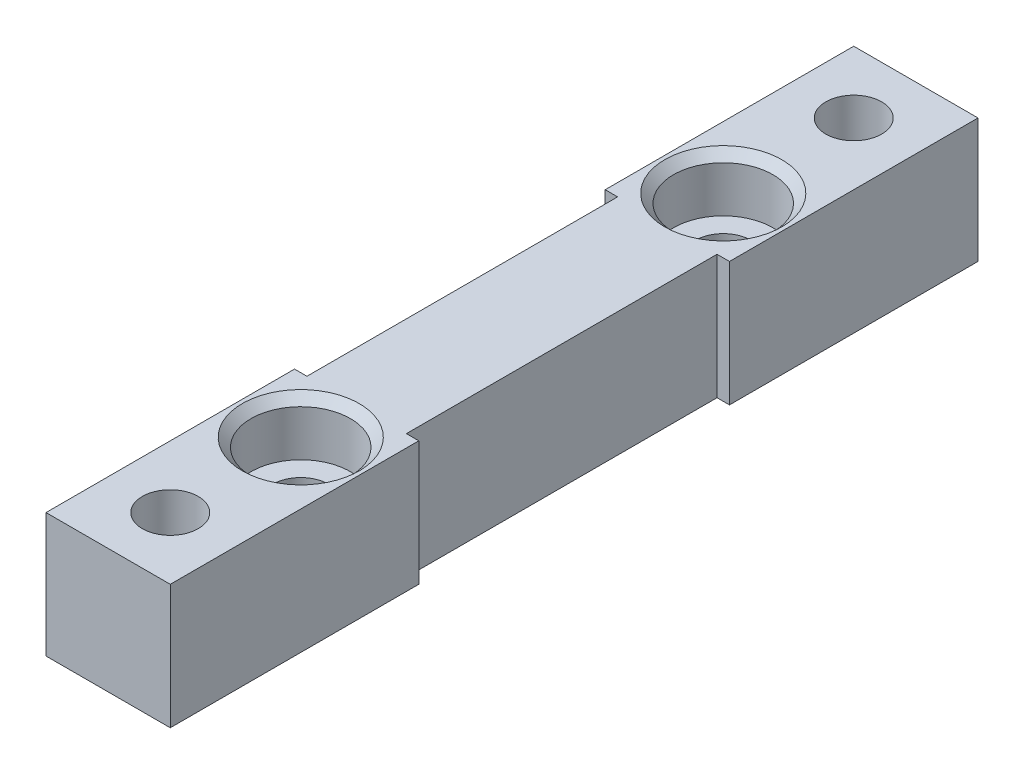
ISO-10303-21;
HEADER;
FILE_DESCRIPTION(('STEP AP214'),'2;1');
FILE_NAME('part.step','',(''),(''),'','','');
FILE_SCHEMA(('AUTOMOTIVE_DESIGN { 1 0 10303 214 1 1 1 1 }'));
ENDSEC;
DATA;
#1=APPLICATION_CONTEXT('core data for automotive mechanical design processes');
#2=APPLICATION_PROTOCOL_DEFINITION('international standard','automotive_design',2000,#1);
#3=PRODUCT_CONTEXT('',#1,'mechanical');
#4=PRODUCT('Part','Part','',(#3));
#5=PRODUCT_RELATED_PRODUCT_CATEGORY('part','',(#4));
#6=PRODUCT_DEFINITION_FORMATION('','',#4);
#7=PRODUCT_DEFINITION_CONTEXT('part definition',#1,'design');
#8=PRODUCT_DEFINITION('design','',#6,#7);
#9=PRODUCT_DEFINITION_SHAPE('','',#8);
#10=(LENGTH_UNIT() NAMED_UNIT(*) SI_UNIT(.MILLI.,.METRE.));
#11=(NAMED_UNIT(*) PLANE_ANGLE_UNIT() SI_UNIT($,.RADIAN.));
#12=(NAMED_UNIT(*) SI_UNIT($,.STERADIAN.) SOLID_ANGLE_UNIT());
#13=UNCERTAINTY_MEASURE_WITH_UNIT(LENGTH_MEASURE(1.E-05),#10,'distance_accuracy_value','');
#14=(GEOMETRIC_REPRESENTATION_CONTEXT(3) GLOBAL_UNCERTAINTY_ASSIGNED_CONTEXT((#13)) GLOBAL_UNIT_ASSIGNED_CONTEXT((#10,
#11,#12)) REPRESENTATION_CONTEXT('',''));
#15=CARTESIAN_POINT('',(0.,0.,0.));
#16=DIRECTION('',(0.,0.,1.));
#17=DIRECTION('',(1.,0.,0.));
#18=AXIS2_PLACEMENT_3D('',#15,#16,#17);
#19=CARTESIAN_POINT('',(0.,0.,0.));
#20=DIRECTION('',(0.,1.,0.));
#21=DIRECTION('',(0.,0.,1.));
#22=AXIS2_PLACEMENT_3D('',#19,#20,#21);
#23=PLANE('',#22);
#24=DIRECTION('',(-0.5,0.,0.866025403784438));
#25=VECTOR('',#24,1.);
#26=CARTESIAN_POINT('',(-8.83345911860128,0.,-5.10000000000001));
#27=LINE('',#26,#25);
#28=CARTESIAN_POINT('',(4.09918691124635,0.,-27.5));
#29=VERTEX_POINT('',#28);
#30=CARTESIAN_POINT('',(2.04959345562318,0.,-23.95));
#31=VERTEX_POINT('',#30);
#32=EDGE_CURVE('E231',#29,#31,#27,.T.);
#33=ORIENTED_EDGE('',*,*,#32,.F.);
#34=DIRECTION('',(0.5,0.,0.866025403784439));
#35=VECTOR('',#34,1.);
#36=CARTESIAN_POINT('',(14.9822394854708,0.,-8.65));
#37=LINE('',#36,#35);
#38=CARTESIAN_POINT('',(2.04959345562318,0.,-31.05));
#39=VERTEX_POINT('',#38);
#40=EDGE_CURVE('E49',#39,#29,#37,.T.);
#41=ORIENTED_EDGE('',*,*,#40,.F.);
#42=DIRECTION('',(1.,0.,0.));
#43=VECTOR('',#42,1.);
#44=CARTESIAN_POINT('',(0.,0.,-31.05));
#45=LINE('',#44,#43);
#46=CARTESIAN_POINT('',(-2.04959345562317,0.,-31.05));
#47=VERTEX_POINT('',#46);
#48=EDGE_CURVE('E220',#47,#39,#45,.T.);
#49=ORIENTED_EDGE('',*,*,#48,.F.);
#50=DIRECTION('',(0.5,0.,-0.866025403784438));
#51=VECTOR('',#50,1.);
#52=CARTESIAN_POINT('',(-14.9822394854708,0.,-8.65000000000001));
#53=LINE('',#52,#51);
#54=CARTESIAN_POINT('',(-4.09918691124634,0.,-27.5));
#55=VERTEX_POINT('',#54);
#56=EDGE_CURVE('E240',#55,#47,#53,.T.);
#57=ORIENTED_EDGE('',*,*,#56,.F.);
#58=DIRECTION('',(-0.5,0.,-0.866025403784439));
#59=VECTOR('',#58,1.);
#60=CARTESIAN_POINT('',(8.83345911860127,0.,-5.1));
#61=LINE('',#60,#59);
#62=CARTESIAN_POINT('',(-2.04959345562317,0.,-23.95));
#63=VERTEX_POINT('',#62);
#64=EDGE_CURVE('E237',#63,#55,#61,.T.);
#65=ORIENTED_EDGE('',*,*,#64,.F.);
#66=DIRECTION('',(-1.,0.,0.));
#67=VECTOR('',#66,1.);
#68=CARTESIAN_POINT('',(0.,0.,-23.95));
#69=LINE('',#68,#67);
#70=EDGE_CURVE('E234',#31,#63,#69,.T.);
#71=ORIENTED_EDGE('',*,*,#70,.F.);
#72=EDGE_LOOP('',(#33,#41,#49,#57,#65,#71));
#73=FACE_BOUND('',#72,.T.);
#74=DIRECTION('',(1.,0.,0.));
#75=VECTOR('',#74,1.);
#76=CARTESIAN_POINT('',(0.,0.,12.5));
#77=LINE('',#76,#75);
#78=CARTESIAN_POINT('',(4.,0.,12.5));
#79=VERTEX_POINT('',#78);
#80=CARTESIAN_POINT('',(5.00000000000001,0.,12.5));
#81=VERTEX_POINT('',#80);
#82=EDGE_CURVE('E333',#79,#81,#77,.T.);
#83=ORIENTED_EDGE('',*,*,#82,.T.);
#84=DIRECTION('',(0.,0.,-1.));
#85=VECTOR('',#84,1.);
#86=CARTESIAN_POINT('',(5.00000000000001,0.,0.));
#87=LINE('',#86,#85);
#88=CARTESIAN_POINT('',(5.,0.,32.5));
#89=VERTEX_POINT('',#88);
#90=EDGE_CURVE('E338',#89,#81,#87,.T.);
#91=ORIENTED_EDGE('',*,*,#90,.F.);
#92=DIRECTION('',(1.,0.,0.));
#93=VECTOR('',#92,1.);
#94=CARTESIAN_POINT('',(0.,0.,32.5));
#95=LINE('',#94,#93);
#96=CARTESIAN_POINT('',(-5.,0.,32.5));
#97=VERTEX_POINT('',#96);
#98=EDGE_CURVE('E387',#97,#89,#95,.T.);
#99=ORIENTED_EDGE('',*,*,#98,.F.);
#100=DIRECTION('',(0.,0.,-1.));
#101=VECTOR('',#100,1.);
#102=CARTESIAN_POINT('',(-5.,0.,0.));
#103=LINE('',#102,#101);
#104=CARTESIAN_POINT('',(-5.,0.,12.5));
#105=VERTEX_POINT('',#104);
#106=EDGE_CURVE('E384',#97,#105,#103,.T.);
#107=ORIENTED_EDGE('',*,*,#106,.T.);
#108=CARTESIAN_POINT('',(-4.,0.,12.5));
#109=VERTEX_POINT('',#108);
#110=EDGE_CURVE('E366',#105,#109,#77,.T.);
#111=ORIENTED_EDGE('',*,*,#110,.T.);
#112=DIRECTION('',(0.,0.,1.));
#113=VECTOR('',#112,1.);
#114=CARTESIAN_POINT('',(-4.,0.,0.));
#115=LINE('',#114,#113);
#116=CARTESIAN_POINT('',(-4.,0.,-12.5));
#117=VERTEX_POINT('',#116);
#118=EDGE_CURVE('E381',#117,#109,#115,.T.);
#119=ORIENTED_EDGE('',*,*,#118,.F.);
#120=DIRECTION('',(1.,0.,0.));
#121=VECTOR('',#120,1.);
#122=CARTESIAN_POINT('',(0.,0.,-12.5));
#123=LINE('',#122,#121);
#124=CARTESIAN_POINT('',(-5.,0.,-12.5));
#125=VERTEX_POINT('',#124);
#126=EDGE_CURVE('E373',#125,#117,#123,.T.);
#127=ORIENTED_EDGE('',*,*,#126,.F.);
#128=DIRECTION('',(0.,0.,1.));
#129=VECTOR('',#128,1.);
#130=CARTESIAN_POINT('',(-5.,0.,0.));
#131=LINE('',#130,#129);
#132=CARTESIAN_POINT('',(-5.,0.,-32.5));
#133=VERTEX_POINT('',#132);
#134=EDGE_CURVE('E379',#133,#125,#131,.T.);
#135=ORIENTED_EDGE('',*,*,#134,.F.);
#136=DIRECTION('',(1.,0.,0.));
#137=VECTOR('',#136,1.);
#138=CARTESIAN_POINT('',(0.,0.,-32.5));
#139=LINE('',#138,#137);
#140=CARTESIAN_POINT('',(5.,0.,-32.5));
#141=VERTEX_POINT('',#140);
#142=EDGE_CURVE('E376',#133,#141,#139,.T.);
#143=ORIENTED_EDGE('',*,*,#142,.T.);
#144=DIRECTION('',(0.,0.,1.));
#145=VECTOR('',#144,1.);
#146=CARTESIAN_POINT('',(5.00000000000001,0.,0.));
#147=LINE('',#146,#145);
#148=CARTESIAN_POINT('',(5.00000000000001,0.,-12.5));
#149=VERTEX_POINT('',#148);
#150=EDGE_CURVE('E372',#141,#149,#147,.T.);
#151=ORIENTED_EDGE('',*,*,#150,.T.);
#152=CARTESIAN_POINT('',(4.,0.,-12.5));
#153=VERTEX_POINT('',#152);
#154=EDGE_CURVE('E369',#153,#149,#123,.T.);
#155=ORIENTED_EDGE('',*,*,#154,.F.);
#156=DIRECTION('',(0.,0.,1.));
#157=VECTOR('',#156,1.);
#158=CARTESIAN_POINT('',(4.,0.,0.));
#159=LINE('',#158,#157);
#160=EDGE_CURVE('E365',#153,#79,#159,.T.);
#161=ORIENTED_EDGE('',*,*,#160,.T.);
#162=EDGE_LOOP('',(#83,#91,#99,#107,#111,#119,#127,#135,#143,#151,#155,#161));
#163=FACE_BOUND('',#162,.T.);
#164=CARTESIAN_POINT('',(0.,0.,17.));
#165=DIRECTION('',(0.,1.,0.));
#166=DIRECTION('',(0.,0.,1.));
#167=AXIS2_PLACEMENT_3D('',#164,#165,#166);
#168=CIRCLE('',#167,2.25);
#169=CARTESIAN_POINT('',(0.,0.,19.25));
#170=VERTEX_POINT('',#169);
#171=EDGE_CURVE('E330',#170,#170,#168,.T.);
#172=ORIENTED_EDGE('',*,*,#171,.T.);
#173=EDGE_LOOP('',(#172));
#174=FACE_BOUND('',#173,.T.);
#175=CARTESIAN_POINT('',(0.,0.,-17.));
#176=DIRECTION('',(0.,1.,0.));
#177=DIRECTION('',(0.,0.,1.));
#178=AXIS2_PLACEMENT_3D('',#175,#176,#177);
#179=CIRCLE('',#178,2.25);
#180=CARTESIAN_POINT('',(0.,0.,-14.75));
#181=VERTEX_POINT('',#180);
#182=EDGE_CURVE('E315',#181,#181,#179,.T.);
#183=ORIENTED_EDGE('',*,*,#182,.T.);
#184=EDGE_LOOP('',(#183));
#185=FACE_BOUND('',#184,.T.);
#186=DIRECTION('',(-1.,0.,0.));
#187=VECTOR('',#186,1.);
#188=CARTESIAN_POINT('',(0.,0.,23.95));
#189=LINE('',#188,#187);
#190=CARTESIAN_POINT('',(2.04959345562317,0.,23.95));
#191=VERTEX_POINT('',#190);
#192=CARTESIAN_POINT('',(-2.04959345562317,0.,23.95));
#193=VERTEX_POINT('',#192);
#194=EDGE_CURVE('E57',#191,#193,#189,.T.);
#195=ORIENTED_EDGE('',*,*,#194,.T.);
#196=DIRECTION('',(-0.5,0.,0.866025403784439));
#197=VECTOR('',#196,1.);
#198=CARTESIAN_POINT('',(8.83345911860127,0.,5.1));
#199=LINE('',#198,#197);
#200=CARTESIAN_POINT('',(-4.09918691124635,0.,27.5));
#201=VERTEX_POINT('',#200);
#202=EDGE_CURVE('E259',#193,#201,#199,.T.);
#203=ORIENTED_EDGE('',*,*,#202,.T.);
#204=DIRECTION('',(0.5,0.,0.866025403784438));
#205=VECTOR('',#204,1.);
#206=CARTESIAN_POINT('',(-14.9822394854708,0.,8.65000000000001));
#207=LINE('',#206,#205);
#208=CARTESIAN_POINT('',(-2.04959345562317,0.,31.05));
#209=VERTEX_POINT('',#208);
#210=EDGE_CURVE('E283',#201,#209,#207,.T.);
#211=ORIENTED_EDGE('',*,*,#210,.T.);
#212=DIRECTION('',(1.,0.,0.));
#213=VECTOR('',#212,1.);
#214=CARTESIAN_POINT('',(0.,0.,31.05));
#215=LINE('',#214,#213);
#216=CARTESIAN_POINT('',(2.04959345562318,0.,31.05));
#217=VERTEX_POINT('',#216);
#218=EDGE_CURVE('E280',#209,#217,#215,.T.);
#219=ORIENTED_EDGE('',*,*,#218,.T.);
#220=DIRECTION('',(0.5,0.,-0.866025403784439));
#221=VECTOR('',#220,1.);
#222=CARTESIAN_POINT('',(14.9822394854708,0.,8.65));
#223=LINE('',#222,#221);
#224=CARTESIAN_POINT('',(4.09918691124635,0.,27.5));
#225=VERTEX_POINT('',#224);
#226=EDGE_CURVE('E277',#217,#225,#223,.T.);
#227=ORIENTED_EDGE('',*,*,#226,.T.);
#228=DIRECTION('',(-0.5,0.,-0.866025403784438));
#229=VECTOR('',#228,1.);
#230=CARTESIAN_POINT('',(-8.83345911860128,0.,5.10000000000001));
#231=LINE('',#230,#229);
#232=EDGE_CURVE('E274',#225,#191,#231,.T.);
#233=ORIENTED_EDGE('',*,*,#232,.T.);
#234=EDGE_LOOP('',(#195,#203,#211,#219,#227,#233));
#235=FACE_BOUND('',#234,.T.);
#236=ADVANCED_FACE('F34',(#73,#163,#174,#185,#235),#23,.F.);
#237=CARTESIAN_POINT('',(0.,0.,-27.5));
#238=DIRECTION('',(0.,-1.,0.));
#239=DIRECTION('',(0.,0.,-1.));
#240=AXIS2_PLACEMENT_3D('',#237,#238,#239);
#241=CYLINDRICAL_SURFACE('',#240,2.25);
#242=CARTESIAN_POINT('',(0.,10.,-27.5));
#243=DIRECTION('',(0.,1.,0.));
#244=DIRECTION('',(0.,0.,1.));
#245=AXIS2_PLACEMENT_3D('',#242,#243,#244);
#246=CIRCLE('',#245,2.25);
#247=CARTESIAN_POINT('',(0.,10.,-25.25));
#248=VERTEX_POINT('',#247);
#249=EDGE_CURVE('E300',#248,#248,#246,.T.);
#250=ORIENTED_EDGE('',*,*,#249,.T.);
#251=EDGE_LOOP('',(#250));
#252=FACE_BOUND('',#251,.T.);
#253=CARTESIAN_POINT('',(0.,4.,-27.5));
#254=DIRECTION('',(0.,-1.,0.));
#255=DIRECTION('',(0.,0.,-1.));
#256=AXIS2_PLACEMENT_3D('',#253,#254,#255);
#257=CIRCLE('',#256,2.25);
#258=CARTESIAN_POINT('',(0.,4.,-29.75));
#259=VERTEX_POINT('',#258);
#260=EDGE_CURVE('E217',#259,#259,#257,.F.);
#261=ORIENTED_EDGE('',*,*,#260,.F.);
#262=EDGE_LOOP('',(#261));
#263=FACE_BOUND('',#262,.T.);
#264=ADVANCED_FACE('F480',(#252,#263),#241,.F.);
#265=CARTESIAN_POINT('',(0.,0.,27.5));
#266=DIRECTION('',(0.,-1.,0.));
#267=DIRECTION('',(0.,0.,-1.));
#268=AXIS2_PLACEMENT_3D('',#265,#266,#267);
#269=CYLINDRICAL_SURFACE('',#268,2.25);
#270=CARTESIAN_POINT('',(0.,10.,27.5));
#271=DIRECTION('',(0.,1.,0.));
#272=DIRECTION('',(0.,0.,1.));
#273=AXIS2_PLACEMENT_3D('',#270,#271,#272);
#274=CIRCLE('',#273,2.25);
#275=CARTESIAN_POINT('',(0.,10.,29.75));
#276=VERTEX_POINT('',#275);
#277=EDGE_CURVE('E247',#276,#276,#274,.T.);
#278=ORIENTED_EDGE('',*,*,#277,.T.);
#279=EDGE_LOOP('',(#278));
#280=FACE_BOUND('',#279,.T.);
#281=CARTESIAN_POINT('',(0.,4.,27.5));
#282=DIRECTION('',(0.,-1.,0.));
#283=DIRECTION('',(0.,0.,-1.));
#284=AXIS2_PLACEMENT_3D('',#281,#282,#283);
#285=CIRCLE('',#284,2.25);
#286=CARTESIAN_POINT('',(0.,4.,25.25));
#287=VERTEX_POINT('',#286);
#288=EDGE_CURVE('E269',#287,#287,#285,.F.);
#289=ORIENTED_EDGE('',*,*,#288,.F.);
#290=EDGE_LOOP('',(#289));
#291=FACE_BOUND('',#290,.T.);
#292=ADVANCED_FACE('F486',(#280,#291),#269,.F.);
#293=CARTESIAN_POINT('',(0.,10.,12.5));
#294=DIRECTION('',(0.,0.,-1.));
#295=DIRECTION('',(-1.,0.,0.));
#296=AXIS2_PLACEMENT_3D('',#293,#294,#295);
#297=PLANE('',#296);
#298=ORIENTED_EDGE('',*,*,#82,.F.);
#299=DIRECTION('',(0.,-1.,0.));
#300=VECTOR('',#299,1.);
#301=CARTESIAN_POINT('',(4.,10.,12.5));
#302=LINE('',#301,#300);
#303=CARTESIAN_POINT('',(4.,10.,12.5));
#304=VERTEX_POINT('',#303);
#305=EDGE_CURVE('E11',#304,#79,#302,.T.);
#306=ORIENTED_EDGE('',*,*,#305,.F.);
#307=DIRECTION('',(1.,0.,0.));
#308=VECTOR('',#307,1.);
#309=CARTESIAN_POINT('',(0.,10.,12.5));
#310=LINE('',#309,#308);
#311=CARTESIAN_POINT('',(5.00000000000001,10.,12.5));
#312=VERTEX_POINT('',#311);
#313=EDGE_CURVE('E334',#304,#312,#310,.T.);
#314=ORIENTED_EDGE('',*,*,#313,.T.);
#315=DIRECTION('',(0.,-1.,0.));
#316=VECTOR('',#315,1.);
#317=CARTESIAN_POINT('',(5.00000000000001,10.,12.5));
#318=LINE('',#317,#316);
#319=EDGE_CURVE('E362',#312,#81,#318,.T.);
#320=ORIENTED_EDGE('',*,*,#319,.T.);
#321=EDGE_LOOP('',(#298,#306,#314,#320));
#322=FACE_BOUND('',#321,.T.);
#323=ADVANCED_FACE('F426',(#322),#297,.T.);
#324=CARTESIAN_POINT('',(4.,10.,0.));
#325=DIRECTION('',(1.,0.,0.));
#326=DIRECTION('',(0.,0.,-1.));
#327=AXIS2_PLACEMENT_3D('',#324,#325,#326);
#328=PLANE('',#327);
#329=ORIENTED_EDGE('',*,*,#160,.F.);
#330=DIRECTION('',(0.,-1.,0.));
#331=VECTOR('',#330,1.);
#332=CARTESIAN_POINT('',(4.,10.,-12.5));
#333=LINE('',#332,#331);
#334=CARTESIAN_POINT('',(4.,10.,-12.5));
#335=VERTEX_POINT('',#334);
#336=EDGE_CURVE('E42',#335,#153,#333,.T.);
#337=ORIENTED_EDGE('',*,*,#336,.F.);
#338=DIRECTION('',(0.,0.,1.));
#339=VECTOR('',#338,1.);
#340=CARTESIAN_POINT('',(4.,10.,0.));
#341=LINE('',#340,#339);
#342=EDGE_CURVE('E337',#335,#304,#341,.T.);
#343=ORIENTED_EDGE('',*,*,#342,.T.);
#344=ORIENTED_EDGE('',*,*,#305,.T.);
#345=EDGE_LOOP('',(#329,#337,#343,#344));
#346=FACE_BOUND('',#345,.T.);
#347=ADVANCED_FACE('F36',(#346),#328,.T.);
#348=CARTESIAN_POINT('',(0.,10.,-12.5));
#349=DIRECTION('',(0.,0.,-1.));
#350=DIRECTION('',(-1.,0.,0.));
#351=AXIS2_PLACEMENT_3D('',#348,#349,#350);
#352=PLANE('',#351);
#353=ORIENTED_EDGE('',*,*,#154,.T.);
#354=DIRECTION('',(0.,-1.,0.));
#355=VECTOR('',#354,1.);
#356=CARTESIAN_POINT('',(5.00000000000001,10.,-12.5));
#357=LINE('',#356,#355);
#358=CARTESIAN_POINT('',(5.00000000000001,10.,-12.5));
#359=VERTEX_POINT('',#358);
#360=EDGE_CURVE('E411',#359,#149,#357,.T.);
#361=ORIENTED_EDGE('',*,*,#360,.F.);
#362=DIRECTION('',(1.,0.,0.));
#363=VECTOR('',#362,1.);
#364=CARTESIAN_POINT('',(0.,10.,-12.5));
#365=LINE('',#364,#363);
#366=EDGE_CURVE('E342',#335,#359,#365,.T.);
#367=ORIENTED_EDGE('',*,*,#366,.F.);
#368=ORIENTED_EDGE('',*,*,#336,.T.);
#369=EDGE_LOOP('',(#353,#361,#367,#368));
#370=FACE_BOUND('',#369,.T.);
#371=ADVANCED_FACE('F415',(#370),#352,.F.);
#372=CARTESIAN_POINT('',(5.00000000000001,10.,0.));
#373=DIRECTION('',(1.,0.,0.));
#374=DIRECTION('',(0.,0.,-1.));
#375=AXIS2_PLACEMENT_3D('',#372,#373,#374);
#376=PLANE('',#375);
#377=ORIENTED_EDGE('',*,*,#150,.F.);
#378=DIRECTION('',(0.,-1.,0.));
#379=VECTOR('',#378,1.);
#380=CARTESIAN_POINT('',(5.,10.,-32.5));
#381=LINE('',#380,#379);
#382=CARTESIAN_POINT('',(5.,10.,-32.5));
#383=VERTEX_POINT('',#382);
#384=EDGE_CURVE('E409',#383,#141,#381,.T.);
#385=ORIENTED_EDGE('',*,*,#384,.F.);
#386=DIRECTION('',(0.,0.,1.));
#387=VECTOR('',#386,1.);
#388=CARTESIAN_POINT('',(5.00000000000001,10.,0.));
#389=LINE('',#388,#387);
#390=EDGE_CURVE('E344',#383,#359,#389,.T.);
#391=ORIENTED_EDGE('',*,*,#390,.T.);
#392=ORIENTED_EDGE('',*,*,#360,.T.);
#393=EDGE_LOOP('',(#377,#385,#391,#392));
#394=FACE_BOUND('',#393,.T.);
#395=ADVANCED_FACE('F467',(#394),#376,.T.);
#396=CARTESIAN_POINT('',(0.,10.,-32.5));
#397=DIRECTION('',(0.,0.,-1.));
#398=DIRECTION('',(-1.,0.,0.));
#399=AXIS2_PLACEMENT_3D('',#396,#397,#398);
#400=PLANE('',#399);
#401=ORIENTED_EDGE('',*,*,#142,.F.);
#402=DIRECTION('',(0.,-1.,0.));
#403=VECTOR('',#402,1.);
#404=CARTESIAN_POINT('',(-5.,10.,-32.5));
#405=LINE('',#404,#403);
#406=CARTESIAN_POINT('',(-5.,10.,-32.5));
#407=VERTEX_POINT('',#406);
#408=EDGE_CURVE('E407',#407,#133,#405,.T.);
#409=ORIENTED_EDGE('',*,*,#408,.F.);
#410=DIRECTION('',(1.,0.,0.));
#411=VECTOR('',#410,1.);
#412=CARTESIAN_POINT('',(0.,10.,-32.5));
#413=LINE('',#412,#411);
#414=EDGE_CURVE('E348',#407,#383,#413,.T.);
#415=ORIENTED_EDGE('',*,*,#414,.T.);
#416=ORIENTED_EDGE('',*,*,#384,.T.);
#417=EDGE_LOOP('',(#401,#409,#415,#416));
#418=FACE_BOUND('',#417,.T.);
#419=ADVANCED_FACE('F462',(#418),#400,.T.);
#420=CARTESIAN_POINT('',(-5.,10.,0.));
#421=DIRECTION('',(1.,0.,0.));
#422=DIRECTION('',(0.,0.,-1.));
#423=AXIS2_PLACEMENT_3D('',#420,#421,#422);
#424=PLANE('',#423);
#425=ORIENTED_EDGE('',*,*,#134,.T.);
#426=DIRECTION('',(0.,-1.,0.));
#427=VECTOR('',#426,1.);
#428=CARTESIAN_POINT('',(-5.,10.,-12.5));
#429=LINE('',#428,#427);
#430=CARTESIAN_POINT('',(-5.,10.,-12.5));
#431=VERTEX_POINT('',#430);
#432=EDGE_CURVE('E404',#431,#125,#429,.T.);
#433=ORIENTED_EDGE('',*,*,#432,.F.);
#434=DIRECTION('',(0.,0.,1.));
#435=VECTOR('',#434,1.);
#436=CARTESIAN_POINT('',(-5.,10.,0.));
#437=LINE('',#436,#435);
#438=EDGE_CURVE('E351',#407,#431,#437,.T.);
#439=ORIENTED_EDGE('',*,*,#438,.F.);
#440=ORIENTED_EDGE('',*,*,#408,.T.);
#441=EDGE_LOOP('',(#425,#433,#439,#440));
#442=FACE_BOUND('',#441,.T.);
#443=ADVANCED_FACE('F470',(#442),#424,.F.);
#444=ORIENTED_EDGE('',*,*,#126,.T.);
#445=DIRECTION('',(0.,-1.,0.));
#446=VECTOR('',#445,1.);
#447=CARTESIAN_POINT('',(-4.,10.,-12.5));
#448=LINE('',#447,#446);
#449=CARTESIAN_POINT('',(-4.,10.,-12.5));
#450=VERTEX_POINT('',#449);
#451=EDGE_CURVE('E401',#450,#117,#448,.T.);
#452=ORIENTED_EDGE('',*,*,#451,.F.);
#453=EDGE_CURVE('E345',#431,#450,#365,.T.);
#454=ORIENTED_EDGE('',*,*,#453,.F.);
#455=ORIENTED_EDGE('',*,*,#432,.T.);
#456=EDGE_LOOP('',(#444,#452,#454,#455));
#457=FACE_BOUND('',#456,.T.);
#458=ADVANCED_FACE('F456',(#457),#352,.F.);
#459=CARTESIAN_POINT('',(-4.,10.,0.));
#460=DIRECTION('',(1.,0.,0.));
#461=DIRECTION('',(0.,0.,-1.));
#462=AXIS2_PLACEMENT_3D('',#459,#460,#461);
#463=PLANE('',#462);
#464=ORIENTED_EDGE('',*,*,#118,.T.);
#465=DIRECTION('',(0.,-1.,0.));
#466=VECTOR('',#465,1.);
#467=CARTESIAN_POINT('',(-4.,10.,12.5));
#468=LINE('',#467,#466);
#469=CARTESIAN_POINT('',(-4.,10.,12.5));
#470=VERTEX_POINT('',#469);
#471=EDGE_CURVE('E399',#470,#109,#468,.T.);
#472=ORIENTED_EDGE('',*,*,#471,.F.);
#473=DIRECTION('',(0.,0.,1.));
#474=VECTOR('',#473,1.);
#475=CARTESIAN_POINT('',(-4.,10.,0.));
#476=LINE('',#475,#474);
#477=EDGE_CURVE('E353',#450,#470,#476,.T.);
#478=ORIENTED_EDGE('',*,*,#477,.F.);
#479=ORIENTED_EDGE('',*,*,#451,.T.);
#480=EDGE_LOOP('',(#464,#472,#478,#479));
#481=FACE_BOUND('',#480,.T.);
#482=ADVANCED_FACE('F452',(#481),#463,.F.);
#483=ORIENTED_EDGE('',*,*,#110,.F.);
#484=DIRECTION('',(0.,-1.,0.));
#485=VECTOR('',#484,1.);
#486=CARTESIAN_POINT('',(-5.,10.,12.5));
#487=LINE('',#486,#485);
#488=CARTESIAN_POINT('',(-5.,10.,12.5));
#489=VERTEX_POINT('',#488);
#490=EDGE_CURVE('E397',#489,#105,#487,.T.);
#491=ORIENTED_EDGE('',*,*,#490,.F.);
#492=EDGE_CURVE('E339',#489,#470,#310,.T.);
#493=ORIENTED_EDGE('',*,*,#492,.T.);
#494=ORIENTED_EDGE('',*,*,#471,.T.);
#495=EDGE_LOOP('',(#483,#491,#493,#494));
#496=FACE_BOUND('',#495,.T.);
#497=ADVANCED_FACE('F446',(#496),#297,.T.);
#498=CARTESIAN_POINT('',(-5.,10.,0.));
#499=DIRECTION('',(-1.,0.,0.));
#500=DIRECTION('',(0.,0.,1.));
#501=AXIS2_PLACEMENT_3D('',#498,#499,#500);
#502=PLANE('',#501);
#503=ORIENTED_EDGE('',*,*,#106,.F.);
#504=DIRECTION('',(0.,-1.,0.));
#505=VECTOR('',#504,1.);
#506=CARTESIAN_POINT('',(-5.,10.,32.5));
#507=LINE('',#506,#505);
#508=CARTESIAN_POINT('',(-5.,10.,32.5));
#509=VERTEX_POINT('',#508);
#510=EDGE_CURVE('E395',#509,#97,#507,.T.);
#511=ORIENTED_EDGE('',*,*,#510,.F.);
#512=DIRECTION('',(0.,0.,-1.));
#513=VECTOR('',#512,1.);
#514=CARTESIAN_POINT('',(-5.,10.,0.));
#515=LINE('',#514,#513);
#516=EDGE_CURVE('E355',#509,#489,#515,.T.);
#517=ORIENTED_EDGE('',*,*,#516,.T.);
#518=ORIENTED_EDGE('',*,*,#490,.T.);
#519=EDGE_LOOP('',(#503,#511,#517,#518));
#520=FACE_BOUND('',#519,.T.);
#521=ADVANCED_FACE('F440',(#520),#502,.T.);
#522=CARTESIAN_POINT('',(0.,10.,32.5));
#523=DIRECTION('',(0.,0.,-1.));
#524=DIRECTION('',(-1.,0.,0.));
#525=AXIS2_PLACEMENT_3D('',#522,#523,#524);
#526=PLANE('',#525);
#527=ORIENTED_EDGE('',*,*,#98,.T.);
#528=DIRECTION('',(0.,-1.,0.));
#529=VECTOR('',#528,1.);
#530=CARTESIAN_POINT('',(5.,10.,32.5));
#531=LINE('',#530,#529);
#532=CARTESIAN_POINT('',(5.,10.,32.5));
#533=VERTEX_POINT('',#532);
#534=EDGE_CURVE('E392',#533,#89,#531,.T.);
#535=ORIENTED_EDGE('',*,*,#534,.F.);
#536=DIRECTION('',(1.,0.,0.));
#537=VECTOR('',#536,1.);
#538=CARTESIAN_POINT('',(0.,10.,32.5));
#539=LINE('',#538,#537);
#540=EDGE_CURVE('E358',#509,#533,#539,.T.);
#541=ORIENTED_EDGE('',*,*,#540,.F.);
#542=ORIENTED_EDGE('',*,*,#510,.T.);
#543=EDGE_LOOP('',(#527,#535,#541,#542));
#544=FACE_BOUND('',#543,.T.);
#545=ADVANCED_FACE('F437',(#544),#526,.F.);
#546=CARTESIAN_POINT('',(5.00000000000001,10.,0.));
#547=DIRECTION('',(-1.,0.,0.));
#548=DIRECTION('',(0.,0.,1.));
#549=AXIS2_PLACEMENT_3D('',#546,#547,#548);
#550=PLANE('',#549);
#551=ORIENTED_EDGE('',*,*,#90,.T.);
#552=ORIENTED_EDGE('',*,*,#319,.F.);
#553=DIRECTION('',(0.,0.,-1.));
#554=VECTOR('',#553,1.);
#555=CARTESIAN_POINT('',(5.00000000000001,10.,0.));
#556=LINE('',#555,#554);
#557=EDGE_CURVE('E360',#533,#312,#556,.T.);
#558=ORIENTED_EDGE('',*,*,#557,.F.);
#559=ORIENTED_EDGE('',*,*,#534,.T.);
#560=EDGE_LOOP('',(#551,#552,#558,#559));
#561=FACE_BOUND('',#560,.T.);
#562=ADVANCED_FACE('F432',(#561),#550,.F.);
#563=CARTESIAN_POINT('',(0.,10.,0.));
#564=DIRECTION('',(0.,1.,0.));
#565=DIRECTION('',(0.,0.,1.));
#566=AXIS2_PLACEMENT_3D('',#563,#564,#565);
#567=PLANE('',#566);
#568=ORIENTED_EDGE('',*,*,#277,.F.);
#569=EDGE_LOOP('',(#568));
#570=FACE_BOUND('',#569,.T.);
#571=ORIENTED_EDGE('',*,*,#249,.F.);
#572=EDGE_LOOP('',(#571));
#573=FACE_BOUND('',#572,.T.);
#574=CARTESIAN_POINT('',(0.,10.,-17.));
#575=DIRECTION('',(0.,1.,0.));
#576=DIRECTION('',(0.,0.,1.));
#577=AXIS2_PLACEMENT_3D('',#574,#575,#576);
#578=CIRCLE('',#577,4.7);
#579=CARTESIAN_POINT('',(0.,10.,-12.3));
#580=VERTEX_POINT('',#579);
#581=EDGE_CURVE('E303',#580,#580,#578,.T.);
#582=ORIENTED_EDGE('',*,*,#581,.F.);
#583=EDGE_LOOP('',(#582));
#584=FACE_BOUND('',#583,.T.);
#585=CARTESIAN_POINT('',(0.,10.,17.));
#586=DIRECTION('',(0.,1.,0.));
#587=DIRECTION('',(0.,0.,1.));
#588=AXIS2_PLACEMENT_3D('',#585,#586,#587);
#589=CIRCLE('',#588,4.7);
#590=CARTESIAN_POINT('',(0.,10.,21.7));
#591=VERTEX_POINT('',#590);
#592=EDGE_CURVE('E318',#591,#591,#589,.T.);
#593=ORIENTED_EDGE('',*,*,#592,.F.);
#594=EDGE_LOOP('',(#593));
#595=FACE_BOUND('',#594,.T.);
#596=ORIENTED_EDGE('',*,*,#313,.F.);
#597=ORIENTED_EDGE('',*,*,#342,.F.);
#598=ORIENTED_EDGE('',*,*,#366,.T.);
#599=ORIENTED_EDGE('',*,*,#390,.F.);
#600=ORIENTED_EDGE('',*,*,#414,.F.);
#601=ORIENTED_EDGE('',*,*,#438,.T.);
#602=ORIENTED_EDGE('',*,*,#453,.T.);
#603=ORIENTED_EDGE('',*,*,#477,.T.);
#604=ORIENTED_EDGE('',*,*,#492,.F.);
#605=ORIENTED_EDGE('',*,*,#516,.F.);
#606=ORIENTED_EDGE('',*,*,#540,.T.);
#607=ORIENTED_EDGE('',*,*,#557,.T.);
#608=EDGE_LOOP('',(#596,#597,#598,#599,#600,#601,#602,#603,#604,#605,#606,#607));
#609=FACE_BOUND('',#608,.T.);
#610=ADVANCED_FACE('F469',(#570,#573,#584,#595,#609),#567,.T.);
#611=CARTESIAN_POINT('',(0.,10.,17.));
#612=DIRECTION('',(0.,1.,0.));
#613=DIRECTION('',(0.,0.,1.));
#614=AXIS2_PLACEMENT_3D('',#611,#612,#613);
#615=CYLINDRICAL_SURFACE('',#614,2.25);
#616=ORIENTED_EDGE('',*,*,#171,.F.);
#617=EDGE_LOOP('',(#616));
#618=FACE_BOUND('',#617,.T.);
#619=CARTESIAN_POINT('',(0.,5.6,17.));
#620=DIRECTION('',(0.,1.,0.));
#621=DIRECTION('',(0.,0.,1.));
#622=AXIS2_PLACEMENT_3D('',#619,#620,#621);
#623=CIRCLE('',#622,2.25);
#624=CARTESIAN_POINT('',(0.,5.6,19.25));
#625=VERTEX_POINT('',#624);
#626=EDGE_CURVE('E327',#625,#625,#623,.T.);
#627=ORIENTED_EDGE('',*,*,#626,.T.);
#628=EDGE_LOOP('',(#627));
#629=FACE_BOUND('',#628,.T.);
#630=ADVANCED_FACE('F528',(#618,#629),#615,.F.);
#631=CARTESIAN_POINT('',(4.00000000000001,5.6,17.));
#632=DIRECTION('',(0.,-1.,0.));
#633=DIRECTION('',(0.,0.,-1.));
#634=AXIS2_PLACEMENT_3D('',#631,#632,#633);
#635=PLANE('',#634);
#636=ORIENTED_EDGE('',*,*,#626,.F.);
#637=EDGE_LOOP('',(#636));
#638=FACE_BOUND('',#637,.T.);
#639=CARTESIAN_POINT('',(0.,5.6,17.));
#640=DIRECTION('',(0.,1.,0.));
#641=DIRECTION('',(0.,0.,1.));
#642=AXIS2_PLACEMENT_3D('',#639,#640,#641);
#643=CIRCLE('',#642,4.);
#644=CARTESIAN_POINT('',(0.,5.6,21.));
#645=VERTEX_POINT('',#644);
#646=EDGE_CURVE('E324',#645,#645,#643,.T.);
#647=ORIENTED_EDGE('',*,*,#646,.T.);
#648=EDGE_LOOP('',(#647));
#649=FACE_BOUND('',#648,.T.);
#650=ADVANCED_FACE('F535',(#638,#649),#635,.F.);
#651=CARTESIAN_POINT('',(0.,10.,17.));
#652=DIRECTION('',(0.,1.,0.));
#653=DIRECTION('',(0.,0.,1.));
#654=AXIS2_PLACEMENT_3D('',#651,#652,#653);
#655=CYLINDRICAL_SURFACE('',#654,4.);
#656=ORIENTED_EDGE('',*,*,#646,.F.);
#657=EDGE_LOOP('',(#656));
#658=FACE_BOUND('',#657,.T.);
#659=CARTESIAN_POINT('',(0.,9.3,17.));
#660=DIRECTION('',(0.,1.,0.));
#661=DIRECTION('',(0.,0.,1.));
#662=AXIS2_PLACEMENT_3D('',#659,#660,#661);
#663=CIRCLE('',#662,4.);
#664=CARTESIAN_POINT('',(0.,9.3,21.));
#665=VERTEX_POINT('',#664);
#666=EDGE_CURVE('E321',#665,#665,#663,.T.);
#667=ORIENTED_EDGE('',*,*,#666,.T.);
#668=EDGE_LOOP('',(#667));
#669=FACE_BOUND('',#668,.T.);
#670=ADVANCED_FACE('F542',(#658,#669),#655,.F.);
#671=CARTESIAN_POINT('',(0.,10.,17.));
#672=DIRECTION('',(0.,1.,0.));
#673=DIRECTION('',(0.,0.,1.));
#674=AXIS2_PLACEMENT_3D('',#671,#672,#673);
#675=CONICAL_SURFACE('',#674,4.7,0.785398163397447);
#676=ORIENTED_EDGE('',*,*,#666,.F.);
#677=EDGE_LOOP('',(#676));
#678=FACE_BOUND('',#677,.T.);
#679=ORIENTED_EDGE('',*,*,#592,.T.);
#680=EDGE_LOOP('',(#679));
#681=FACE_BOUND('',#680,.T.);
#682=ADVANCED_FACE('F550',(#678,#681),#675,.F.);
#683=CARTESIAN_POINT('',(0.,10.,-17.));
#684=DIRECTION('',(0.,1.,0.));
#685=DIRECTION('',(0.,0.,1.));
#686=AXIS2_PLACEMENT_3D('',#683,#684,#685);
#687=CYLINDRICAL_SURFACE('',#686,2.25);
#688=ORIENTED_EDGE('',*,*,#182,.F.);
#689=EDGE_LOOP('',(#688));
#690=FACE_BOUND('',#689,.T.);
#691=CARTESIAN_POINT('',(0.,5.6,-17.));
#692=DIRECTION('',(0.,1.,0.));
#693=DIRECTION('',(0.,0.,1.));
#694=AXIS2_PLACEMENT_3D('',#691,#692,#693);
#695=CIRCLE('',#694,2.25);
#696=CARTESIAN_POINT('',(0.,5.6,-14.75));
#697=VERTEX_POINT('',#696);
#698=EDGE_CURVE('E312',#697,#697,#695,.T.);
#699=ORIENTED_EDGE('',*,*,#698,.T.);
#700=EDGE_LOOP('',(#699));
#701=FACE_BOUND('',#700,.T.);
#702=ADVANCED_FACE('F558',(#690,#701),#687,.F.);
#703=CARTESIAN_POINT('',(4.00000000000001,5.6,-17.));
#704=DIRECTION('',(0.,-1.,0.));
#705=DIRECTION('',(0.,0.,-1.));
#706=AXIS2_PLACEMENT_3D('',#703,#704,#705);
#707=PLANE('',#706);
#708=ORIENTED_EDGE('',*,*,#698,.F.);
#709=EDGE_LOOP('',(#708));
#710=FACE_BOUND('',#709,.T.);
#711=CARTESIAN_POINT('',(0.,5.6,-17.));
#712=DIRECTION('',(0.,1.,0.));
#713=DIRECTION('',(0.,0.,1.));
#714=AXIS2_PLACEMENT_3D('',#711,#712,#713);
#715=CIRCLE('',#714,4.);
#716=CARTESIAN_POINT('',(0.,5.6,-13.));
#717=VERTEX_POINT('',#716);
#718=EDGE_CURVE('E309',#717,#717,#715,.T.);
#719=ORIENTED_EDGE('',*,*,#718,.T.);
#720=EDGE_LOOP('',(#719));
#721=FACE_BOUND('',#720,.T.);
#722=ADVANCED_FACE('F566',(#710,#721),#707,.F.);
#723=CARTESIAN_POINT('',(0.,10.,-17.));
#724=DIRECTION('',(0.,1.,0.));
#725=DIRECTION('',(0.,0.,1.));
#726=AXIS2_PLACEMENT_3D('',#723,#724,#725);
#727=CYLINDRICAL_SURFACE('',#726,4.);
#728=ORIENTED_EDGE('',*,*,#718,.F.);
#729=EDGE_LOOP('',(#728));
#730=FACE_BOUND('',#729,.T.);
#731=CARTESIAN_POINT('',(0.,9.3,-17.));
#732=DIRECTION('',(0.,1.,0.));
#733=DIRECTION('',(0.,0.,1.));
#734=AXIS2_PLACEMENT_3D('',#731,#732,#733);
#735=CIRCLE('',#734,4.);
#736=CARTESIAN_POINT('',(0.,9.3,-13.));
#737=VERTEX_POINT('',#736);
#738=EDGE_CURVE('E306',#737,#737,#735,.T.);
#739=ORIENTED_EDGE('',*,*,#738,.T.);
#740=EDGE_LOOP('',(#739));
#741=FACE_BOUND('',#740,.T.);
#742=ADVANCED_FACE('F574',(#730,#741),#727,.F.);
#743=CARTESIAN_POINT('',(0.,10.,-17.));
#744=DIRECTION('',(0.,1.,0.));
#745=DIRECTION('',(0.,0.,1.));
#746=AXIS2_PLACEMENT_3D('',#743,#744,#745);
#747=CONICAL_SURFACE('',#746,4.7,0.785398163397447);
#748=ORIENTED_EDGE('',*,*,#738,.F.);
#749=EDGE_LOOP('',(#748));
#750=FACE_BOUND('',#749,.T.);
#751=ORIENTED_EDGE('',*,*,#581,.T.);
#752=EDGE_LOOP('',(#751));
#753=FACE_BOUND('',#752,.T.);
#754=ADVANCED_FACE('F582',(#750,#753),#747,.F.);
#755=CARTESIAN_POINT('',(0.,4.,23.95));
#756=DIRECTION('',(0.,0.,1.));
#757=DIRECTION('',(1.,0.,0.));
#758=AXIS2_PLACEMENT_3D('',#755,#756,#757);
#759=PLANE('',#758);
#760=ORIENTED_EDGE('',*,*,#194,.F.);
#761=DIRECTION('',(0.,-1.,0.));
#762=VECTOR('',#761,1.);
#763=CARTESIAN_POINT('',(2.04959345562318,4.,23.95));
#764=LINE('',#763,#762);
#765=CARTESIAN_POINT('',(2.04959345562318,4.,23.95));
#766=VERTEX_POINT('',#765);
#767=EDGE_CURVE('E272',#766,#191,#764,.T.);
#768=ORIENTED_EDGE('',*,*,#767,.F.);
#769=DIRECTION('',(-1.,0.,0.));
#770=VECTOR('',#769,1.);
#771=CARTESIAN_POINT('',(0.,4.,23.95));
#772=LINE('',#771,#770);
#773=CARTESIAN_POINT('',(-2.04959345562317,4.,23.95));
#774=VERTEX_POINT('',#773);
#775=EDGE_CURVE('E255',#766,#774,#772,.T.);
#776=ORIENTED_EDGE('',*,*,#775,.T.);
#777=DIRECTION('',(0.,-1.,0.));
#778=VECTOR('',#777,1.);
#779=CARTESIAN_POINT('',(-2.04959345562317,4.,23.95));
#780=LINE('',#779,#778);
#781=EDGE_CURVE('E232',#774,#193,#780,.T.);
#782=ORIENTED_EDGE('',*,*,#781,.T.);
#783=EDGE_LOOP('',(#760,#768,#776,#782));
#784=FACE_BOUND('',#783,.T.);
#785=ADVANCED_FACE('F589',(#784),#759,.T.);
#786=CARTESIAN_POINT('',(8.83345911860127,4.,5.1));
#787=DIRECTION('',(0.866025403784439,0.,0.5));
#788=DIRECTION('',(0.5,0.,-0.866025403784439));
#789=AXIS2_PLACEMENT_3D('',#786,#787,#788);
#790=PLANE('',#789);
#791=ORIENTED_EDGE('',*,*,#202,.F.);
#792=ORIENTED_EDGE('',*,*,#781,.F.);
#793=DIRECTION('',(-0.5,0.,0.866025403784439));
#794=VECTOR('',#793,1.);
#795=CARTESIAN_POINT('',(8.83345911860127,4.,5.1));
#796=LINE('',#795,#794);
#797=CARTESIAN_POINT('',(-4.09918691124635,4.,27.5));
#798=VERTEX_POINT('',#797);
#799=EDGE_CURVE('E267',#774,#798,#796,.T.);
#800=ORIENTED_EDGE('',*,*,#799,.T.);
#801=DIRECTION('',(0.,-1.,0.));
#802=VECTOR('',#801,1.);
#803=CARTESIAN_POINT('',(-4.09918691124635,4.,27.5));
#804=LINE('',#803,#802);
#805=EDGE_CURVE('E289',#798,#201,#804,.T.);
#806=ORIENTED_EDGE('',*,*,#805,.T.);
#807=EDGE_LOOP('',(#791,#792,#800,#806));
#808=FACE_BOUND('',#807,.T.);
#809=ADVANCED_FACE('F597',(#808),#790,.T.);
#810=CARTESIAN_POINT('',(-14.9822394854708,4.,8.65000000000001));
#811=DIRECTION('',(0.866025403784438,0.,-0.5));
#812=DIRECTION('',(-0.5,0.,-0.866025403784438));
#813=AXIS2_PLACEMENT_3D('',#810,#811,#812);
#814=PLANE('',#813);
#815=ORIENTED_EDGE('',*,*,#210,.F.);
#816=ORIENTED_EDGE('',*,*,#805,.F.);
#817=DIRECTION('',(0.5,0.,0.866025403784438));
#818=VECTOR('',#817,1.);
#819=CARTESIAN_POINT('',(-14.9822394854708,4.,8.65000000000001));
#820=LINE('',#819,#818);
#821=CARTESIAN_POINT('',(-2.04959345562317,4.,31.05));
#822=VERTEX_POINT('',#821);
#823=EDGE_CURVE('E265',#798,#822,#820,.T.);
#824=ORIENTED_EDGE('',*,*,#823,.T.);
#825=DIRECTION('',(0.,-1.,0.));
#826=VECTOR('',#825,1.);
#827=CARTESIAN_POINT('',(-2.04959345562317,4.,31.05));
#828=LINE('',#827,#826);
#829=EDGE_CURVE('E291',#822,#209,#828,.T.);
#830=ORIENTED_EDGE('',*,*,#829,.T.);
#831=EDGE_LOOP('',(#815,#816,#824,#830));
#832=FACE_BOUND('',#831,.T.);
#833=ADVANCED_FACE('F605',(#832),#814,.T.);
#834=CARTESIAN_POINT('',(0.,4.,31.05));
#835=DIRECTION('',(0.,0.,-1.));
#836=DIRECTION('',(-1.,0.,0.));
#837=AXIS2_PLACEMENT_3D('',#834,#835,#836);
#838=PLANE('',#837);
#839=ORIENTED_EDGE('',*,*,#218,.F.);
#840=ORIENTED_EDGE('',*,*,#829,.F.);
#841=DIRECTION('',(1.,0.,0.));
#842=VECTOR('',#841,1.);
#843=CARTESIAN_POINT('',(0.,4.,31.05));
#844=LINE('',#843,#842);
#845=CARTESIAN_POINT('',(2.04959345562318,4.,31.05));
#846=VERTEX_POINT('',#845);
#847=EDGE_CURVE('E263',#822,#846,#844,.T.);
#848=ORIENTED_EDGE('',*,*,#847,.T.);
#849=DIRECTION('',(0.,-1.,0.));
#850=VECTOR('',#849,1.);
#851=CARTESIAN_POINT('',(2.04959345562318,4.,31.05));
#852=LINE('',#851,#850);
#853=EDGE_CURVE('E293',#846,#217,#852,.T.);
#854=ORIENTED_EDGE('',*,*,#853,.T.);
#855=EDGE_LOOP('',(#839,#840,#848,#854));
#856=FACE_BOUND('',#855,.T.);
#857=ADVANCED_FACE('F613',(#856),#838,.T.);
#858=CARTESIAN_POINT('',(14.9822394854708,4.,8.65));
#859=DIRECTION('',(-0.866025403784439,0.,-0.5));
#860=DIRECTION('',(-0.5,0.,0.866025403784439));
#861=AXIS2_PLACEMENT_3D('',#858,#859,#860);
#862=PLANE('',#861);
#863=ORIENTED_EDGE('',*,*,#226,.F.);
#864=ORIENTED_EDGE('',*,*,#853,.F.);
#865=DIRECTION('',(0.5,0.,-0.866025403784439));
#866=VECTOR('',#865,1.);
#867=CARTESIAN_POINT('',(14.9822394854708,4.,8.65));
#868=LINE('',#867,#866);
#869=CARTESIAN_POINT('',(4.09918691124635,4.,27.5));
#870=VERTEX_POINT('',#869);
#871=EDGE_CURVE('E261',#846,#870,#868,.T.);
#872=ORIENTED_EDGE('',*,*,#871,.T.);
#873=DIRECTION('',(0.,-1.,0.));
#874=VECTOR('',#873,1.);
#875=CARTESIAN_POINT('',(4.09918691124635,4.,27.5));
#876=LINE('',#875,#874);
#877=EDGE_CURVE('E295',#870,#225,#876,.T.);
#878=ORIENTED_EDGE('',*,*,#877,.T.);
#879=EDGE_LOOP('',(#863,#864,#872,#878));
#880=FACE_BOUND('',#879,.T.);
#881=ADVANCED_FACE('F621',(#880),#862,.T.);
#882=CARTESIAN_POINT('',(-8.83345911860128,4.,5.10000000000001));
#883=DIRECTION('',(-0.866025403784438,0.,0.5));
#884=DIRECTION('',(0.5,0.,0.866025403784438));
#885=AXIS2_PLACEMENT_3D('',#882,#883,#884);
#886=PLANE('',#885);
#887=ORIENTED_EDGE('',*,*,#232,.F.);
#888=ORIENTED_EDGE('',*,*,#877,.F.);
#889=DIRECTION('',(-0.5,0.,-0.866025403784438));
#890=VECTOR('',#889,1.);
#891=CARTESIAN_POINT('',(-8.83345911860128,4.,5.10000000000001));
#892=LINE('',#891,#890);
#893=EDGE_CURVE('E258',#870,#766,#892,.T.);
#894=ORIENTED_EDGE('',*,*,#893,.T.);
#895=ORIENTED_EDGE('',*,*,#767,.T.);
#896=EDGE_LOOP('',(#887,#888,#894,#895));
#897=FACE_BOUND('',#896,.T.);
#898=ADVANCED_FACE('F629',(#897),#886,.T.);
#899=CARTESIAN_POINT('',(0.,4.,0.));
#900=DIRECTION('',(0.,-1.,0.));
#901=DIRECTION('',(0.,0.,-1.));
#902=AXIS2_PLACEMENT_3D('',#899,#900,#901);
#903=PLANE('',#902);
#904=ORIENTED_EDGE('',*,*,#775,.F.);
#905=ORIENTED_EDGE('',*,*,#893,.F.);
#906=ORIENTED_EDGE('',*,*,#871,.F.);
#907=ORIENTED_EDGE('',*,*,#847,.F.);
#908=ORIENTED_EDGE('',*,*,#823,.F.);
#909=ORIENTED_EDGE('',*,*,#799,.F.);
#910=EDGE_LOOP('',(#904,#905,#906,#907,#908,#909));
#911=FACE_BOUND('',#910,.T.);
#912=ORIENTED_EDGE('',*,*,#288,.T.);
#913=EDGE_LOOP('',(#912));
#914=FACE_BOUND('',#913,.T.);
#915=ADVANCED_FACE('F637',(#911,#914),#903,.T.);
#916=CARTESIAN_POINT('',(14.9822394854708,4.,-8.65));
#917=DIRECTION('',(0.866025403784439,0.,-0.5));
#918=DIRECTION('',(-0.5,0.,-0.866025403784439));
#919=AXIS2_PLACEMENT_3D('',#916,#917,#918);
#920=PLANE('',#919);
#921=ORIENTED_EDGE('',*,*,#40,.T.);
#922=DIRECTION('',(0.,-1.,0.));
#923=VECTOR('',#922,1.);
#924=CARTESIAN_POINT('',(4.09918691124635,4.,-27.5));
#925=LINE('',#924,#923);
#926=CARTESIAN_POINT('',(4.09918691124635,4.,-27.5));
#927=VERTEX_POINT('',#926);
#928=EDGE_CURVE('E194',#927,#29,#925,.T.);
#929=ORIENTED_EDGE('',*,*,#928,.F.);
#930=DIRECTION('',(0.5,0.,0.866025403784439));
#931=VECTOR('',#930,1.);
#932=CARTESIAN_POINT('',(14.9822394854708,4.,-8.65));
#933=LINE('',#932,#931);
#934=CARTESIAN_POINT('',(2.04959345562318,4.,-31.05));
#935=VERTEX_POINT('',#934);
#936=EDGE_CURVE('E198',#935,#927,#933,.T.);
#937=ORIENTED_EDGE('',*,*,#936,.F.);
#938=DIRECTION('',(0.,-1.,0.));
#939=VECTOR('',#938,1.);
#940=CARTESIAN_POINT('',(2.04959345562318,4.,-31.05));
#941=LINE('',#940,#939);
#942=EDGE_CURVE('E245',#935,#39,#941,.T.);
#943=ORIENTED_EDGE('',*,*,#942,.T.);
#944=EDGE_LOOP('',(#921,#929,#937,#943));
#945=FACE_BOUND('',#944,.T.);
#946=ADVANCED_FACE('F196',(#945),#920,.F.);
#947=CARTESIAN_POINT('',(0.,4.,-31.05));
#948=DIRECTION('',(0.,0.,-1.));
#949=DIRECTION('',(-1.,0.,0.));
#950=AXIS2_PLACEMENT_3D('',#947,#948,#949);
#951=PLANE('',#950);
#952=ORIENTED_EDGE('',*,*,#48,.T.);
#953=ORIENTED_EDGE('',*,*,#942,.F.);
#954=DIRECTION('',(1.,0.,0.));
#955=VECTOR('',#954,1.);
#956=CARTESIAN_POINT('',(0.,4.,-31.05));
#957=LINE('',#956,#955);
#958=CARTESIAN_POINT('',(-2.04959345562317,4.,-31.05));
#959=VERTEX_POINT('',#958);
#960=EDGE_CURVE('E204',#959,#935,#957,.T.);
#961=ORIENTED_EDGE('',*,*,#960,.F.);
#962=DIRECTION('',(0.,-1.,0.));
#963=VECTOR('',#962,1.);
#964=CARTESIAN_POINT('',(-2.04959345562317,4.,-31.05));
#965=LINE('',#964,#963);
#966=EDGE_CURVE('E248',#959,#47,#965,.T.);
#967=ORIENTED_EDGE('',*,*,#966,.T.);
#968=EDGE_LOOP('',(#952,#953,#961,#967));
#969=FACE_BOUND('',#968,.T.);
#970=ADVANCED_FACE('F652',(#969),#951,.F.);
#971=CARTESIAN_POINT('',(-14.9822394854708,4.,-8.65000000000001));
#972=DIRECTION('',(-0.866025403784438,0.,-0.5));
#973=DIRECTION('',(-0.5,0.,0.866025403784438));
#974=AXIS2_PLACEMENT_3D('',#971,#972,#973);
#975=PLANE('',#974);
#976=ORIENTED_EDGE('',*,*,#56,.T.);
#977=ORIENTED_EDGE('',*,*,#966,.F.);
#978=DIRECTION('',(0.5,0.,-0.866025403784438));
#979=VECTOR('',#978,1.);
#980=CARTESIAN_POINT('',(-14.9822394854708,4.,-8.65000000000001));
#981=LINE('',#980,#979);
#982=CARTESIAN_POINT('',(-4.09918691124634,4.,-27.5));
#983=VERTEX_POINT('',#982);
#984=EDGE_CURVE('E227',#983,#959,#981,.T.);
#985=ORIENTED_EDGE('',*,*,#984,.F.);
#986=DIRECTION('',(0.,-1.,0.));
#987=VECTOR('',#986,1.);
#988=CARTESIAN_POINT('',(-4.09918691124634,4.,-27.5));
#989=LINE('',#988,#987);
#990=EDGE_CURVE('E250',#983,#55,#989,.T.);
#991=ORIENTED_EDGE('',*,*,#990,.T.);
#992=EDGE_LOOP('',(#976,#977,#985,#991));
#993=FACE_BOUND('',#992,.T.);
#994=ADVANCED_FACE('F659',(#993),#975,.F.);
#995=CARTESIAN_POINT('',(8.83345911860127,4.,-5.1));
#996=DIRECTION('',(-0.866025403784439,0.,0.5));
#997=DIRECTION('',(0.5,0.,0.866025403784439));
#998=AXIS2_PLACEMENT_3D('',#995,#996,#997);
#999=PLANE('',#998);
#1000=ORIENTED_EDGE('',*,*,#64,.T.);
#1001=ORIENTED_EDGE('',*,*,#990,.F.);
#1002=DIRECTION('',(-0.5,0.,-0.866025403784439));
#1003=VECTOR('',#1002,1.);
#1004=CARTESIAN_POINT('',(8.83345911860127,4.,-5.1));
#1005=LINE('',#1004,#1003);
#1006=CARTESIAN_POINT('',(-2.04959345562317,4.,-23.95));
#1007=VERTEX_POINT('',#1006);
#1008=EDGE_CURVE('E224',#1007,#983,#1005,.T.);
#1009=ORIENTED_EDGE('',*,*,#1008,.F.);
#1010=DIRECTION('',(0.,-1.,0.));
#1011=VECTOR('',#1010,1.);
#1012=CARTESIAN_POINT('',(-2.04959345562317,4.,-23.95));
#1013=LINE('',#1012,#1011);
#1014=EDGE_CURVE('E252',#1007,#63,#1013,.T.);
#1015=ORIENTED_EDGE('',*,*,#1014,.T.);
#1016=EDGE_LOOP('',(#1000,#1001,#1009,#1015));
#1017=FACE_BOUND('',#1016,.T.);
#1018=ADVANCED_FACE('F667',(#1017),#999,.F.);
#1019=CARTESIAN_POINT('',(0.,4.,-23.95));
#1020=DIRECTION('',(0.,0.,1.));
#1021=DIRECTION('',(1.,0.,0.));
#1022=AXIS2_PLACEMENT_3D('',#1019,#1020,#1021);
#1023=PLANE('',#1022);
#1024=ORIENTED_EDGE('',*,*,#70,.T.);
#1025=ORIENTED_EDGE('',*,*,#1014,.F.);
#1026=DIRECTION('',(-1.,0.,0.));
#1027=VECTOR('',#1026,1.);
#1028=CARTESIAN_POINT('',(0.,4.,-23.95));
#1029=LINE('',#1028,#1027);
#1030=CARTESIAN_POINT('',(2.04959345562318,4.,-23.95));
#1031=VERTEX_POINT('',#1030);
#1032=EDGE_CURVE('E212',#1031,#1007,#1029,.T.);
#1033=ORIENTED_EDGE('',*,*,#1032,.F.);
#1034=DIRECTION('',(0.,-1.,0.));
#1035=VECTOR('',#1034,1.);
#1036=CARTESIAN_POINT('',(2.04959345562318,4.,-23.95));
#1037=LINE('',#1036,#1035);
#1038=EDGE_CURVE('E203',#1031,#31,#1037,.T.);
#1039=ORIENTED_EDGE('',*,*,#1038,.T.);
#1040=EDGE_LOOP('',(#1024,#1025,#1033,#1039));
#1041=FACE_BOUND('',#1040,.T.);
#1042=ADVANCED_FACE('F675',(#1041),#1023,.F.);
#1043=CARTESIAN_POINT('',(-8.83345911860128,4.,-5.10000000000001));
#1044=DIRECTION('',(0.866025403784438,0.,0.5));
#1045=DIRECTION('',(0.5,0.,-0.866025403784438));
#1046=AXIS2_PLACEMENT_3D('',#1043,#1044,#1045);
#1047=PLANE('',#1046);
#1048=ORIENTED_EDGE('',*,*,#32,.T.);
#1049=ORIENTED_EDGE('',*,*,#1038,.F.);
#1050=DIRECTION('',(-0.5,0.,0.866025403784438));
#1051=VECTOR('',#1050,1.);
#1052=CARTESIAN_POINT('',(-8.83345911860128,4.,-5.10000000000001));
#1053=LINE('',#1052,#1051);
#1054=EDGE_CURVE('E207',#927,#1031,#1053,.T.);
#1055=ORIENTED_EDGE('',*,*,#1054,.F.);
#1056=ORIENTED_EDGE('',*,*,#928,.T.);
#1057=EDGE_LOOP('',(#1048,#1049,#1055,#1056));
#1058=FACE_BOUND('',#1057,.T.);
#1059=ADVANCED_FACE('F208',(#1058),#1047,.F.);
#1060=CARTESIAN_POINT('',(0.,4.,0.));
#1061=DIRECTION('',(0.,-1.,0.));
#1062=DIRECTION('',(0.,0.,-1.));
#1063=AXIS2_PLACEMENT_3D('',#1060,#1061,#1062);
#1064=PLANE('',#1063);
#1065=ORIENTED_EDGE('',*,*,#260,.T.);
#1066=EDGE_LOOP('',(#1065));
#1067=FACE_BOUND('',#1066,.T.);
#1068=ORIENTED_EDGE('',*,*,#936,.T.);
#1069=ORIENTED_EDGE('',*,*,#1054,.T.);
#1070=ORIENTED_EDGE('',*,*,#1032,.T.);
#1071=ORIENTED_EDGE('',*,*,#1008,.T.);
#1072=ORIENTED_EDGE('',*,*,#984,.T.);
#1073=ORIENTED_EDGE('',*,*,#960,.T.);
#1074=EDGE_LOOP('',(#1068,#1069,#1070,#1071,#1072,#1073));
#1075=FACE_BOUND('',#1074,.T.);
#1076=ADVANCED_FACE('F214',(#1067,#1075),#1064,.T.);
#1077=CLOSED_SHELL('',(#236,#264,#292,#323,#347,#371,#395,#419,#443,#458,#482,#497,#521,#545,
#562,#610,#630,#650,#670,#682,#702,#722,#742,#754,#785,#809,#833,#857,#881,#898,#915,#946,#970,
#994,#1018,#1042,#1059,#1076));
#1078=MANIFOLD_SOLID_BREP('B2',#1077);
#1079=ADVANCED_BREP_SHAPE_REPRESENTATION('',(#18,#1078),#14);
#1080=SHAPE_DEFINITION_REPRESENTATION(#9,#1079);
ENDSEC;
END-ISO-10303-21;
